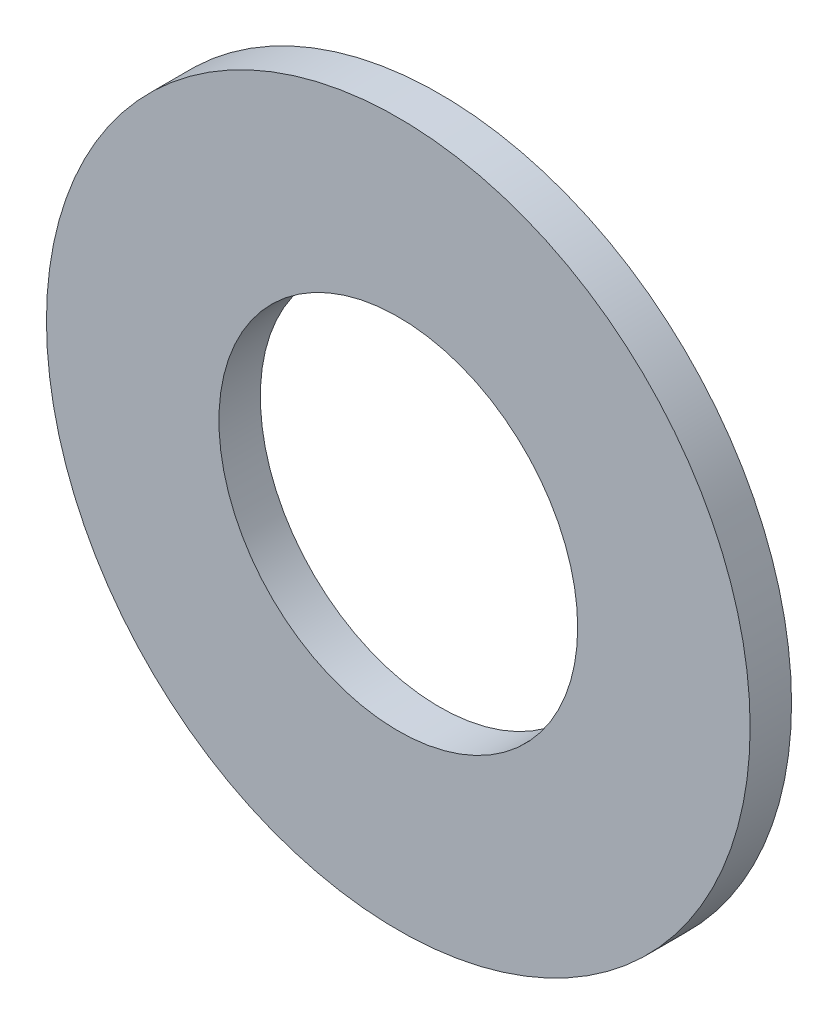
ISO-10303-21;
HEADER;
FILE_DESCRIPTION(('STEP AP214'),'2;1');
FILE_NAME('part.step','',(''),(''),'','','');
FILE_SCHEMA(('AUTOMOTIVE_DESIGN { 1 0 10303 214 1 1 1 1 }'));
ENDSEC;
DATA;
#1=APPLICATION_CONTEXT('core data for automotive mechanical design processes');
#2=APPLICATION_PROTOCOL_DEFINITION('international standard','automotive_design',2000,#1);
#3=PRODUCT_CONTEXT('',#1,'mechanical');
#4=PRODUCT('Part','Part','',(#3));
#5=PRODUCT_RELATED_PRODUCT_CATEGORY('part','',(#4));
#6=PRODUCT_DEFINITION_FORMATION('','',#4);
#7=PRODUCT_DEFINITION_CONTEXT('part definition',#1,'design');
#8=PRODUCT_DEFINITION('design','',#6,#7);
#9=PRODUCT_DEFINITION_SHAPE('','',#8);
#10=(LENGTH_UNIT() NAMED_UNIT(*) SI_UNIT(.MILLI.,.METRE.));
#11=(NAMED_UNIT(*) PLANE_ANGLE_UNIT() SI_UNIT($,.RADIAN.));
#12=(NAMED_UNIT(*) SI_UNIT($,.STERADIAN.) SOLID_ANGLE_UNIT());
#13=UNCERTAINTY_MEASURE_WITH_UNIT(LENGTH_MEASURE(1.E-05),#10,'distance_accuracy_value','');
#14=(GEOMETRIC_REPRESENTATION_CONTEXT(3) GLOBAL_UNCERTAINTY_ASSIGNED_CONTEXT((#13)) GLOBAL_UNIT_ASSIGNED_CONTEXT((#10,
#11,#12)) REPRESENTATION_CONTEXT('',''));
#15=CARTESIAN_POINT('',(0.,0.,0.));
#16=DIRECTION('',(0.,0.,1.));
#17=DIRECTION('',(1.,0.,0.));
#18=AXIS2_PLACEMENT_3D('',#15,#16,#17);
#19=CARTESIAN_POINT('',(0.,0.,0.6));
#20=DIRECTION('',(0.,0.,-1.));
#21=DIRECTION('',(-1.,0.,0.));
#22=AXIS2_PLACEMENT_3D('',#19,#20,#21);
#23=PLANE('',#22);
#24=CARTESIAN_POINT('',(0.,0.,0.6));
#25=DIRECTION('',(0.,0.,1.));
#26=DIRECTION('',(1.,0.,0.));
#27=AXIS2_PLACEMENT_3D('',#24,#25,#26);
#28=CIRCLE('',#27,2.6);
#29=CARTESIAN_POINT('',(2.6,0.,0.6));
#30=VERTEX_POINT('',#29);
#31=EDGE_CURVE('E26',#30,#30,#28,.F.);
#32=ORIENTED_EDGE('',*,*,#31,.T.);
#33=EDGE_LOOP('',(#32));
#34=FACE_BOUND('',#33,.T.);
#35=CARTESIAN_POINT('',(0.,0.,0.6));
#36=DIRECTION('',(0.,0.,1.));
#37=DIRECTION('',(1.,0.,0.));
#38=AXIS2_PLACEMENT_3D('',#35,#36,#37);
#39=CIRCLE('',#38,5.1);
#40=CARTESIAN_POINT('',(5.1,0.,0.6));
#41=VERTEX_POINT('',#40);
#42=EDGE_CURVE('E17',#41,#41,#39,.F.);
#43=ORIENTED_EDGE('',*,*,#42,.F.);
#44=EDGE_LOOP('',(#43));
#45=FACE_BOUND('',#44,.T.);
#46=ADVANCED_FACE('F14',(#34,#45),#23,.F.);
#47=CARTESIAN_POINT('',(0.,0.,0.));
#48=DIRECTION('',(0.,0.,1.));
#49=DIRECTION('',(1.,0.,0.));
#50=AXIS2_PLACEMENT_3D('',#47,#48,#49);
#51=CYLINDRICAL_SURFACE('',#50,5.1);
#52=CARTESIAN_POINT('',(0.,0.,0.));
#53=DIRECTION('',(0.,0.,1.));
#54=DIRECTION('',(1.,0.,0.));
#55=AXIS2_PLACEMENT_3D('',#52,#53,#54);
#56=CIRCLE('',#55,5.1);
#57=CARTESIAN_POINT('',(5.1,0.,0.));
#58=VERTEX_POINT('',#57);
#59=EDGE_CURVE('E21',#58,#58,#56,.F.);
#60=ORIENTED_EDGE('',*,*,#59,.F.);
#61=EDGE_LOOP('',(#60));
#62=FACE_BOUND('',#61,.T.);
#63=ORIENTED_EDGE('',*,*,#42,.T.);
#64=EDGE_LOOP('',(#63));
#65=FACE_BOUND('',#64,.T.);
#66=ADVANCED_FACE('F34',(#62,#65),#51,.T.);
#67=CARTESIAN_POINT('',(0.,0.,0.));
#68=DIRECTION('',(0.,0.,1.));
#69=DIRECTION('',(1.,0.,0.));
#70=AXIS2_PLACEMENT_3D('',#67,#68,#69);
#71=CYLINDRICAL_SURFACE('',#70,2.6);
#72=ORIENTED_EDGE('',*,*,#31,.F.);
#73=EDGE_LOOP('',(#72));
#74=FACE_BOUND('',#73,.T.);
#75=CARTESIAN_POINT('',(0.,0.,0.));
#76=DIRECTION('',(0.,0.,1.));
#77=DIRECTION('',(1.,0.,0.));
#78=AXIS2_PLACEMENT_3D('',#75,#76,#77);
#79=CIRCLE('',#78,2.6);
#80=CARTESIAN_POINT('',(2.6,0.,0.));
#81=VERTEX_POINT('',#80);
#82=EDGE_CURVE('E10',#81,#81,#79,.T.);
#83=ORIENTED_EDGE('',*,*,#82,.F.);
#84=EDGE_LOOP('',(#83));
#85=FACE_BOUND('',#84,.T.);
#86=ADVANCED_FACE('F41',(#74,#85),#71,.F.);
#87=CARTESIAN_POINT('',(0.,0.,0.));
#88=DIRECTION('',(0.,0.,-1.));
#89=DIRECTION('',(-1.,0.,0.));
#90=AXIS2_PLACEMENT_3D('',#87,#88,#89);
#91=PLANE('',#90);
#92=ORIENTED_EDGE('',*,*,#82,.T.);
#93=EDGE_LOOP('',(#92));
#94=FACE_BOUND('',#93,.T.);
#95=ORIENTED_EDGE('',*,*,#59,.T.);
#96=EDGE_LOOP('',(#95));
#97=FACE_BOUND('',#96,.T.);
#98=ADVANCED_FACE('F43',(#94,#97),#91,.T.);
#99=CLOSED_SHELL('',(#46,#66,#86,#98));
#100=MANIFOLD_SOLID_BREP('B1',#99);
#101=ADVANCED_BREP_SHAPE_REPRESENTATION('',(#18,#100),#14);
#102=SHAPE_DEFINITION_REPRESENTATION(#9,#101);
ENDSEC;
END-ISO-10303-21;
